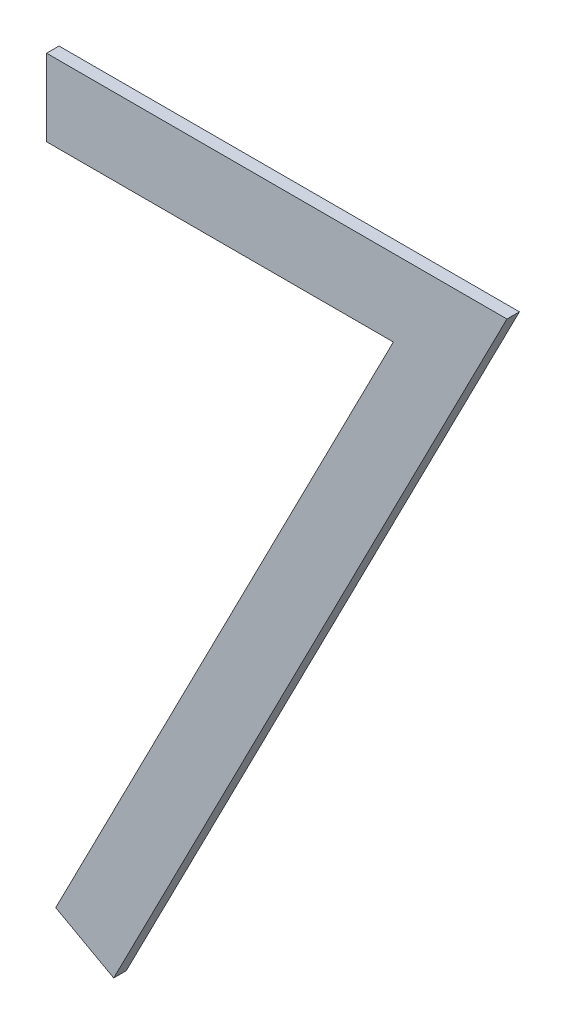
ISO-10303-21;
HEADER;
FILE_DESCRIPTION(('STEP AP214'),'2;1');
FILE_NAME('part.step','',(''),(''),'','','');
FILE_SCHEMA(('AUTOMOTIVE_DESIGN { 1 0 10303 214 1 1 1 1 }'));
ENDSEC;
DATA;
#1=APPLICATION_CONTEXT('core data for automotive mechanical design processes');
#2=APPLICATION_PROTOCOL_DEFINITION('international standard','automotive_design',2000,#1);
#3=PRODUCT_CONTEXT('',#1,'mechanical');
#4=PRODUCT('Part','Part','',(#3));
#5=PRODUCT_RELATED_PRODUCT_CATEGORY('part','',(#4));
#6=PRODUCT_DEFINITION_FORMATION('','',#4);
#7=PRODUCT_DEFINITION_CONTEXT('part definition',#1,'design');
#8=PRODUCT_DEFINITION('design','',#6,#7);
#9=PRODUCT_DEFINITION_SHAPE('','',#8);
#10=(LENGTH_UNIT() NAMED_UNIT(*) SI_UNIT(.MILLI.,.METRE.));
#11=(NAMED_UNIT(*) PLANE_ANGLE_UNIT() SI_UNIT($,.RADIAN.));
#12=(NAMED_UNIT(*) SI_UNIT($,.STERADIAN.) SOLID_ANGLE_UNIT());
#13=UNCERTAINTY_MEASURE_WITH_UNIT(LENGTH_MEASURE(1.E-05),#10,'distance_accuracy_value','');
#14=(GEOMETRIC_REPRESENTATION_CONTEXT(3) GLOBAL_UNCERTAINTY_ASSIGNED_CONTEXT((#13)) GLOBAL_UNIT_ASSIGNED_CONTEXT((#10,
#11,#12)) REPRESENTATION_CONTEXT('',''));
#15=CARTESIAN_POINT('',(0.,0.,0.));
#16=DIRECTION('',(0.,0.,1.));
#17=DIRECTION('',(1.,0.,0.));
#18=AXIS2_PLACEMENT_3D('',#15,#16,#17);
#19=CARTESIAN_POINT('',(1.37230769230769,0.24390475768074,0.551));
#20=DIRECTION('',(-1.,0.,0.));
#21=DIRECTION('',(0.,0.,1.));
#22=AXIS2_PLACEMENT_3D('',#19,#20,#21);
#23=PLANE('',#22);
#24=DIRECTION('',(0.,1.,0.));
#25=VECTOR('',#24,1.);
#26=CARTESIAN_POINT('',(1.37230769230769,0.24390475768074,0.55));
#27=LINE('',#26,#25);
#28=CARTESIAN_POINT('',(1.37230769230769,0.24390475768074,0.55));
#29=VERTEX_POINT('',#28);
#30=CARTESIAN_POINT('',(1.37230769230769,0.250058603834586,0.55));
#31=VERTEX_POINT('',#30);
#32=EDGE_CURVE('E11',#29,#31,#27,.T.);
#33=ORIENTED_EDGE('',*,*,#32,.F.);
#34=DIRECTION('',(0.,0.,-1.));
#35=VECTOR('',#34,1.);
#36=CARTESIAN_POINT('',(1.37230769230769,0.24390475768074,0.551));
#37=LINE('',#36,#35);
#38=CARTESIAN_POINT('',(1.37230769230769,0.24390475768074,0.551));
#39=VERTEX_POINT('',#38);
#40=EDGE_CURVE('E119',#39,#29,#37,.T.);
#41=ORIENTED_EDGE('',*,*,#40,.F.);
#42=DIRECTION('',(0.,1.,0.));
#43=VECTOR('',#42,1.);
#44=CARTESIAN_POINT('',(1.37230769230769,0.24390475768074,0.551));
#45=LINE('',#44,#43);
#46=CARTESIAN_POINT('',(1.37230769230769,0.250058603834586,0.551));
#47=VERTEX_POINT('',#46);
#48=EDGE_CURVE('E112',#39,#47,#45,.T.);
#49=ORIENTED_EDGE('',*,*,#48,.T.);
#50=DIRECTION('',(0.,0.,-1.));
#51=VECTOR('',#50,1.);
#52=CARTESIAN_POINT('',(1.37230769230769,0.250058603834586,0.551));
#53=LINE('',#52,#51);
#54=EDGE_CURVE('E85',#47,#31,#53,.T.);
#55=ORIENTED_EDGE('',*,*,#54,.T.);
#56=EDGE_LOOP('',(#33,#41,#49,#55));
#57=FACE_BOUND('',#56,.T.);
#58=ADVANCED_FACE('F17',(#57),#23,.T.);
#59=CARTESIAN_POINT('',(1.40012019230769,0.24390475768074,0.551));
#60=DIRECTION('',(0.,-1.,0.));
#61=DIRECTION('',(0.,0.,-1.));
#62=AXIS2_PLACEMENT_3D('',#59,#60,#61);
#63=PLANE('',#62);
#64=DIRECTION('',(-1.,0.,0.));
#65=VECTOR('',#64,1.);
#66=CARTESIAN_POINT('',(1.40012019230769,0.24390475768074,0.55));
#67=LINE('',#66,#65);
#68=CARTESIAN_POINT('',(1.40012019230769,0.24390475768074,0.55));
#69=VERTEX_POINT('',#68);
#70=EDGE_CURVE('E24',#69,#29,#67,.T.);
#71=ORIENTED_EDGE('',*,*,#70,.F.);
#72=DIRECTION('',(-2.22044604925006E-13,0.,-1.));
#73=VECTOR('',#72,1.);
#74=CARTESIAN_POINT('',(1.40012019230769,0.24390475768074,0.551));
#75=LINE('',#74,#73);
#76=CARTESIAN_POINT('',(1.40012019230769,0.24390475768074,0.551));
#77=VERTEX_POINT('',#76);
#78=EDGE_CURVE('E114',#77,#69,#75,.T.);
#79=ORIENTED_EDGE('',*,*,#78,.F.);
#80=DIRECTION('',(-1.,0.,0.));
#81=VECTOR('',#80,1.);
#82=CARTESIAN_POINT('',(1.40012019230769,0.24390475768074,0.551));
#83=LINE('',#82,#81);
#84=EDGE_CURVE('E103',#77,#39,#83,.T.);
#85=ORIENTED_EDGE('',*,*,#84,.T.);
#86=ORIENTED_EDGE('',*,*,#40,.T.);
#87=EDGE_LOOP('',(#71,#79,#85,#86));
#88=FACE_BOUND('',#87,.T.);
#89=ADVANCED_FACE('F127',(#88),#63,.T.);
#90=CARTESIAN_POINT('',(1.37304086538462,0.191080238449971,0.551));
#91=DIRECTION('',(-0.889887017756644,0.456180989989924,0.));
#92=DIRECTION('',(-0.456180989989924,-0.889887017756644,0.));
#93=AXIS2_PLACEMENT_3D('',#90,#91,#92);
#94=PLANE('',#93);
#95=DIRECTION('',(0.456180989989924,0.889887017756644,0.));
#96=VECTOR('',#95,1.);
#97=CARTESIAN_POINT('',(1.37304086538462,0.191080238449971,0.55));
#98=LINE('',#97,#96);
#99=CARTESIAN_POINT('',(1.37304086538462,0.191080238449971,0.55));
#100=VERTEX_POINT('',#99);
#101=EDGE_CURVE('E116',#100,#69,#98,.T.);
#102=ORIENTED_EDGE('',*,*,#101,.F.);
#103=DIRECTION('',(0.,0.,-1.));
#104=VECTOR('',#103,1.);
#105=CARTESIAN_POINT('',(1.37304086538462,0.191080238449971,0.551));
#106=LINE('',#105,#104);
#107=CARTESIAN_POINT('',(1.37304086538462,0.191080238449971,0.551));
#108=VERTEX_POINT('',#107);
#109=EDGE_CURVE('E106',#108,#100,#106,.T.);
#110=ORIENTED_EDGE('',*,*,#109,.F.);
#111=DIRECTION('',(0.456180989989924,0.889887017756644,0.));
#112=VECTOR('',#111,1.);
#113=CARTESIAN_POINT('',(1.37304086538462,0.191080238449971,0.551));
#114=LINE('',#113,#112);
#115=EDGE_CURVE('E96',#108,#77,#114,.T.);
#116=ORIENTED_EDGE('',*,*,#115,.T.);
#117=ORIENTED_EDGE('',*,*,#78,.T.);
#118=EDGE_LOOP('',(#102,#110,#116,#117));
#119=FACE_BOUND('',#118,.T.);
#120=ADVANCED_FACE('F123',(#119),#94,.T.);
#121=CARTESIAN_POINT('',(1.37769230769231,0.188520142296125,0.551));
#122=DIRECTION('',(-0.482179429384517,-0.876072484374679,0.));
#123=DIRECTION('',(0.876072484374679,-0.482179429384517,0.));
#124=AXIS2_PLACEMENT_3D('',#121,#122,#123);
#125=PLANE('',#124);
#126=DIRECTION('',(-0.876072484374679,0.482179429384516,0.));
#127=VECTOR('',#126,1.);
#128=CARTESIAN_POINT('',(1.37769230769231,0.188520142296125,0.55));
#129=LINE('',#128,#127);
#130=CARTESIAN_POINT('',(1.37769230769231,0.188520142296125,0.55));
#131=VERTEX_POINT('',#130);
#132=EDGE_CURVE('E109',#131,#100,#129,.T.);
#133=ORIENTED_EDGE('',*,*,#132,.F.);
#134=DIRECTION('',(0.,0.,-1.));
#135=VECTOR('',#134,1.);
#136=CARTESIAN_POINT('',(1.37769230769231,0.188520142296125,0.551));
#137=LINE('',#136,#135);
#138=CARTESIAN_POINT('',(1.37769230769231,0.188520142296125,0.551));
#139=VERTEX_POINT('',#138);
#140=EDGE_CURVE('E99',#139,#131,#137,.T.);
#141=ORIENTED_EDGE('',*,*,#140,.F.);
#142=DIRECTION('',(-0.876072484374679,0.482179429384516,0.));
#143=VECTOR('',#142,1.);
#144=CARTESIAN_POINT('',(1.37769230769231,0.188520142296125,0.551));
#145=LINE('',#144,#143);
#146=EDGE_CURVE('E79',#139,#108,#145,.T.);
#147=ORIENTED_EDGE('',*,*,#146,.T.);
#148=ORIENTED_EDGE('',*,*,#109,.T.);
#149=EDGE_LOOP('',(#133,#141,#147,#148));
#150=FACE_BOUND('',#149,.T.);
#151=ADVANCED_FACE('F125',(#150),#125,.T.);
#152=CARTESIAN_POINT('',(1.40923076923077,0.250058603834586,0.551));
#153=DIRECTION('',(0.889933250556876,-0.456090790910399,0.));
#154=DIRECTION('',(0.456090790910399,0.889933250556876,0.));
#155=AXIS2_PLACEMENT_3D('',#152,#153,#154);
#156=PLANE('',#155);
#157=DIRECTION('',(-0.456090790910398,-0.889933250556876,0.));
#158=VECTOR('',#157,1.);
#159=CARTESIAN_POINT('',(1.40923076923077,0.250058603834586,0.55));
#160=LINE('',#159,#158);
#161=CARTESIAN_POINT('',(1.40923076923077,0.250058603834586,0.55));
#162=VERTEX_POINT('',#161);
#163=EDGE_CURVE('E74',#162,#131,#160,.T.);
#164=ORIENTED_EDGE('',*,*,#163,.F.);
#165=DIRECTION('',(0.,0.,-1.));
#166=VECTOR('',#165,1.);
#167=CARTESIAN_POINT('',(1.40923076923077,0.250058603834586,0.551));
#168=LINE('',#167,#166);
#169=CARTESIAN_POINT('',(1.40923076923077,0.250058603834586,0.551));
#170=VERTEX_POINT('',#169);
#171=EDGE_CURVE('E66',#170,#162,#168,.T.);
#172=ORIENTED_EDGE('',*,*,#171,.F.);
#173=DIRECTION('',(-0.456090790910398,-0.889933250556876,0.));
#174=VECTOR('',#173,1.);
#175=CARTESIAN_POINT('',(1.40923076923077,0.250058603834586,0.551));
#176=LINE('',#175,#174);
#177=EDGE_CURVE('E71',#170,#139,#176,.T.);
#178=ORIENTED_EDGE('',*,*,#177,.T.);
#179=ORIENTED_EDGE('',*,*,#140,.T.);
#180=EDGE_LOOP('',(#164,#172,#178,#179));
#181=FACE_BOUND('',#180,.T.);
#182=ADVANCED_FACE('F68',(#181),#156,.T.);
#183=CARTESIAN_POINT('',(1.37230769230769,0.250058603834586,0.551));
#184=DIRECTION('',(0.,1.,0.));
#185=DIRECTION('',(0.,0.,1.));
#186=AXIS2_PLACEMENT_3D('',#183,#184,#185);
#187=PLANE('',#186);
#188=DIRECTION('',(1.,0.,0.));
#189=VECTOR('',#188,1.);
#190=CARTESIAN_POINT('',(1.37230769230769,0.250058603834586,0.55));
#191=LINE('',#190,#189);
#192=EDGE_CURVE('E78',#31,#162,#191,.T.);
#193=ORIENTED_EDGE('',*,*,#192,.F.);
#194=ORIENTED_EDGE('',*,*,#54,.F.);
#195=DIRECTION('',(1.,0.,0.));
#196=VECTOR('',#195,1.);
#197=CARTESIAN_POINT('',(1.37230769230769,0.250058603834586,0.551));
#198=LINE('',#197,#196);
#199=EDGE_CURVE('E83',#47,#170,#198,.T.);
#200=ORIENTED_EDGE('',*,*,#199,.T.);
#201=ORIENTED_EDGE('',*,*,#171,.T.);
#202=EDGE_LOOP('',(#193,#194,#200,#201));
#203=FACE_BOUND('',#202,.T.);
#204=ADVANCED_FACE('F84',(#203),#187,.T.);
#205=CARTESIAN_POINT('',(0.,0.,0.551));
#206=DIRECTION('',(0.,0.,-1.));
#207=DIRECTION('',(-1.,0.,0.));
#208=AXIS2_PLACEMENT_3D('',#205,#206,#207);
#209=PLANE('',#208);
#210=ORIENTED_EDGE('',*,*,#48,.F.);
#211=ORIENTED_EDGE('',*,*,#84,.F.);
#212=ORIENTED_EDGE('',*,*,#115,.F.);
#213=ORIENTED_EDGE('',*,*,#146,.F.);
#214=ORIENTED_EDGE('',*,*,#177,.F.);
#215=ORIENTED_EDGE('',*,*,#199,.F.);
#216=EDGE_LOOP('',(#210,#211,#212,#213,#214,#215));
#217=FACE_BOUND('',#216,.T.);
#218=ADVANCED_FACE('F89',(#217),#209,.F.);
#219=CARTESIAN_POINT('',(0.,0.,0.55));
#220=DIRECTION('',(0.,0.,-1.));
#221=DIRECTION('',(-1.,0.,0.));
#222=AXIS2_PLACEMENT_3D('',#219,#220,#221);
#223=PLANE('',#222);
#224=ORIENTED_EDGE('',*,*,#32,.T.);
#225=ORIENTED_EDGE('',*,*,#192,.T.);
#226=ORIENTED_EDGE('',*,*,#163,.T.);
#227=ORIENTED_EDGE('',*,*,#132,.T.);
#228=ORIENTED_EDGE('',*,*,#101,.T.);
#229=ORIENTED_EDGE('',*,*,#70,.T.);
#230=EDGE_LOOP('',(#224,#225,#226,#227,#228,#229));
#231=FACE_BOUND('',#230,.T.);
#232=ADVANCED_FACE('F121',(#231),#223,.T.);
#233=CLOSED_SHELL('',(#58,#89,#120,#151,#182,#204,#218,#232));
#234=MANIFOLD_SOLID_BREP('B1',#233);
#235=ADVANCED_BREP_SHAPE_REPRESENTATION('',(#18,#234),#14);
#236=SHAPE_DEFINITION_REPRESENTATION(#9,#235);
ENDSEC;
END-ISO-10303-21;
